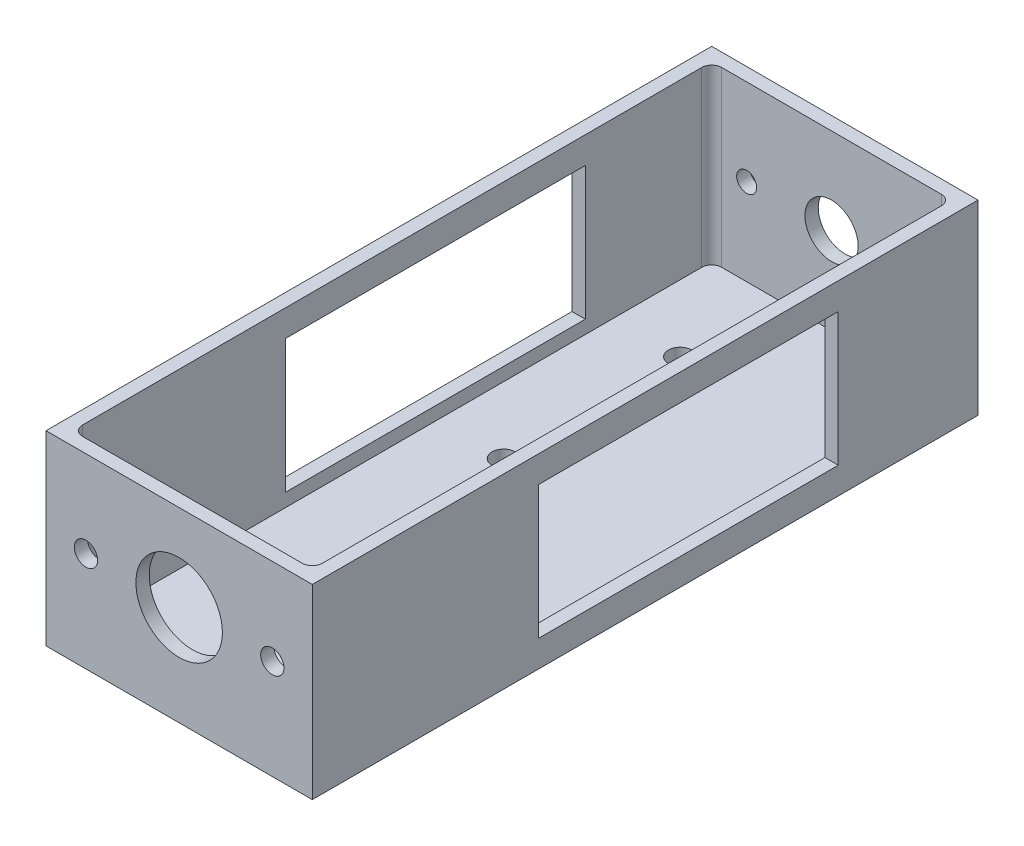
ISO-10303-21;
HEADER;
FILE_DESCRIPTION(('STEP AP214'),'2;1');
FILE_NAME('part.step','',(''),(''),'','','');
FILE_SCHEMA(('AUTOMOTIVE_DESIGN { 1 0 10303 214 1 1 1 1 }'));
ENDSEC;
DATA;
#1=APPLICATION_CONTEXT('core data for automotive mechanical design processes');
#2=APPLICATION_PROTOCOL_DEFINITION('international standard','automotive_design',2000,#1);
#3=PRODUCT_CONTEXT('',#1,'mechanical');
#4=PRODUCT('Part','Part','',(#3));
#5=PRODUCT_RELATED_PRODUCT_CATEGORY('part','',(#4));
#6=PRODUCT_DEFINITION_FORMATION('','',#4);
#7=PRODUCT_DEFINITION_CONTEXT('part definition',#1,'design');
#8=PRODUCT_DEFINITION('design','',#6,#7);
#9=PRODUCT_DEFINITION_SHAPE('','',#8);
#10=(LENGTH_UNIT() NAMED_UNIT(*) SI_UNIT(.MILLI.,.METRE.));
#11=(NAMED_UNIT(*) PLANE_ANGLE_UNIT() SI_UNIT($,.RADIAN.));
#12=(NAMED_UNIT(*) SI_UNIT($,.STERADIAN.) SOLID_ANGLE_UNIT());
#13=UNCERTAINTY_MEASURE_WITH_UNIT(LENGTH_MEASURE(1.E-05),#10,'distance_accuracy_value','');
#14=(GEOMETRIC_REPRESENTATION_CONTEXT(3) GLOBAL_UNCERTAINTY_ASSIGNED_CONTEXT((#13)) GLOBAL_UNIT_ASSIGNED_CONTEXT((#10,
#11,#12)) REPRESENTATION_CONTEXT('',''));
#15=CARTESIAN_POINT('',(0.,0.,0.));
#16=DIRECTION('',(0.,0.,1.));
#17=DIRECTION('',(1.,0.,0.));
#18=AXIS2_PLACEMENT_3D('',#15,#16,#17);
#19=CARTESIAN_POINT('',(-40.,28.,-200.));
#20=DIRECTION('',(0.,1.,0.));
#21=DIRECTION('',(0.,0.,1.));
#22=AXIS2_PLACEMENT_3D('',#19,#20,#21);
#23=PLANE('',#22);
#24=DIRECTION('',(-1.,0.,0.));
#25=VECTOR('',#24,1.);
#26=CARTESIAN_POINT('',(-40.,28.,0.));
#27=LINE('',#26,#25);
#28=CARTESIAN_POINT('',(40.,28.,0.));
#29=VERTEX_POINT('',#28);
#30=CARTESIAN_POINT('',(-40.,28.,0.));
#31=VERTEX_POINT('',#30);
#32=EDGE_CURVE('E344',#29,#31,#27,.T.);
#33=ORIENTED_EDGE('',*,*,#32,.F.);
#34=DIRECTION('',(0.,0.,1.));
#35=VECTOR('',#34,1.);
#36=CARTESIAN_POINT('',(40.,28.,-200.));
#37=LINE('',#36,#35);
#38=CARTESIAN_POINT('',(40.,28.,-200.));
#39=VERTEX_POINT('',#38);
#40=EDGE_CURVE('E341',#39,#29,#37,.T.);
#41=ORIENTED_EDGE('',*,*,#40,.F.);
#42=DIRECTION('',(-1.,0.,0.));
#43=VECTOR('',#42,1.);
#44=CARTESIAN_POINT('',(-40.,28.,-200.));
#45=LINE('',#44,#43);
#46=CARTESIAN_POINT('',(-40.,28.,-200.));
#47=VERTEX_POINT('',#46);
#48=EDGE_CURVE('E331',#39,#47,#45,.T.);
#49=ORIENTED_EDGE('',*,*,#48,.T.);
#50=DIRECTION('',(0.,0.,1.));
#51=VECTOR('',#50,1.);
#52=CARTESIAN_POINT('',(-40.,28.,-200.));
#53=LINE('',#52,#51);
#54=EDGE_CURVE('E357',#47,#31,#53,.T.);
#55=ORIENTED_EDGE('',*,*,#54,.T.);
#56=EDGE_LOOP('',(#33,#41,#49,#55));
#57=FACE_BOUND('',#56,.T.);
#58=DIRECTION('',(0.,0.,1.));
#59=VECTOR('',#58,1.);
#60=CARTESIAN_POINT('',(-36.,28.,0.));
#61=LINE('',#60,#59);
#62=CARTESIAN_POINT('',(-36.,28.,-193.));
#63=VERTEX_POINT('',#62);
#64=CARTESIAN_POINT('',(-36.,28.,-7.));
#65=VERTEX_POINT('',#64);
#66=EDGE_CURVE('E291',#63,#65,#61,.T.);
#67=ORIENTED_EDGE('',*,*,#66,.F.);
#68=CARTESIAN_POINT('',(-33.,28.,-193.));
#69=DIRECTION('',(0.,1.,0.));
#70=DIRECTION('',(0.,0.,1.));
#71=AXIS2_PLACEMENT_3D('',#68,#69,#70);
#72=CIRCLE('',#71,3.);
#73=CARTESIAN_POINT('',(-33.,28.,-196.));
#74=VERTEX_POINT('',#73);
#75=EDGE_CURVE('E288',#63,#74,#72,.F.);
#76=ORIENTED_EDGE('',*,*,#75,.T.);
#77=DIRECTION('',(-1.,0.,0.));
#78=VECTOR('',#77,1.);
#79=CARTESIAN_POINT('',(0.,28.,-196.));
#80=LINE('',#79,#78);
#81=CARTESIAN_POINT('',(33.,28.,-196.));
#82=VERTEX_POINT('',#81);
#83=EDGE_CURVE('E266',#82,#74,#80,.T.);
#84=ORIENTED_EDGE('',*,*,#83,.F.);
#85=CARTESIAN_POINT('',(33.,28.,-193.));
#86=DIRECTION('',(0.,1.,0.));
#87=DIRECTION('',(0.,0.,1.));
#88=AXIS2_PLACEMENT_3D('',#85,#86,#87);
#89=CIRCLE('',#88,3.00000000000001);
#90=CARTESIAN_POINT('',(36.,28.,-193.));
#91=VERTEX_POINT('',#90);
#92=EDGE_CURVE('E306',#91,#82,#89,.T.);
#93=ORIENTED_EDGE('',*,*,#92,.F.);
#94=DIRECTION('',(0.,0.,-1.));
#95=VECTOR('',#94,1.);
#96=CARTESIAN_POINT('',(36.,28.,0.));
#97=LINE('',#96,#95);
#98=CARTESIAN_POINT('',(36.,28.,-7.));
#99=VERTEX_POINT('',#98);
#100=EDGE_CURVE('E303',#99,#91,#97,.T.);
#101=ORIENTED_EDGE('',*,*,#100,.F.);
#102=CARTESIAN_POINT('',(33.,28.,-7.));
#103=DIRECTION('',(0.,1.,0.));
#104=DIRECTION('',(0.,0.,1.));
#105=AXIS2_PLACEMENT_3D('',#102,#103,#104);
#106=CIRCLE('',#105,3.);
#107=CARTESIAN_POINT('',(33.,28.,-4.));
#108=VERTEX_POINT('',#107);
#109=EDGE_CURVE('E300',#108,#99,#106,.T.);
#110=ORIENTED_EDGE('',*,*,#109,.F.);
#111=DIRECTION('',(1.,0.,0.));
#112=VECTOR('',#111,1.);
#113=CARTESIAN_POINT('',(0.,28.,-4.));
#114=LINE('',#113,#112);
#115=CARTESIAN_POINT('',(-33.,28.,-4.));
#116=VERTEX_POINT('',#115);
#117=EDGE_CURVE('E297',#116,#108,#114,.T.);
#118=ORIENTED_EDGE('',*,*,#117,.F.);
#119=CARTESIAN_POINT('',(-33.,28.,-7.));
#120=DIRECTION('',(0.,1.,0.));
#121=DIRECTION('',(0.,0.,1.));
#122=AXIS2_PLACEMENT_3D('',#119,#120,#121);
#123=CIRCLE('',#122,3.00000000000001);
#124=EDGE_CURVE('E294',#65,#116,#123,.T.);
#125=ORIENTED_EDGE('',*,*,#124,.F.);
#126=EDGE_LOOP('',(#67,#76,#84,#93,#101,#110,#118,#125));
#127=FACE_BOUND('',#126,.T.);
#128=ADVANCED_FACE('F34',(#57,#127),#23,.T.);
#129=CARTESIAN_POINT('',(40.,-28.,-200.));
#130=DIRECTION('',(1.,0.,0.));
#131=DIRECTION('',(0.,0.,-1.));
#132=AXIS2_PLACEMENT_3D('',#129,#130,#131);
#133=PLANE('',#132);
#134=DIRECTION('',(0.,1.,0.));
#135=VECTOR('',#134,1.);
#136=CARTESIAN_POINT('',(40.,-20.,-68.0147093473397));
#137=LINE('',#136,#135);
#138=CARTESIAN_POINT('',(40.,-20.,-68.0147093473397));
#139=VERTEX_POINT('',#138);
#140=CARTESIAN_POINT('',(40.,20.,-68.0147093473397));
#141=VERTEX_POINT('',#140);
#142=EDGE_CURVE('E178',#139,#141,#137,.T.);
#143=ORIENTED_EDGE('',*,*,#142,.T.);
#144=DIRECTION('',(0.,0.,-1.));
#145=VECTOR('',#144,1.);
#146=CARTESIAN_POINT('',(40.,20.,-158.01470934734));
#147=LINE('',#146,#145);
#148=CARTESIAN_POINT('',(40.,20.,-158.01470934734));
#149=VERTEX_POINT('',#148);
#150=EDGE_CURVE('E188',#141,#149,#147,.T.);
#151=ORIENTED_EDGE('',*,*,#150,.T.);
#152=DIRECTION('',(0.,-1.,0.));
#153=VECTOR('',#152,1.);
#154=CARTESIAN_POINT('',(40.,-20.,-158.01470934734));
#155=LINE('',#154,#153);
#156=CARTESIAN_POINT('',(40.,-20.,-158.01470934734));
#157=VERTEX_POINT('',#156);
#158=EDGE_CURVE('E49',#149,#157,#155,.T.);
#159=ORIENTED_EDGE('',*,*,#158,.T.);
#160=DIRECTION('',(0.,0.,1.));
#161=VECTOR('',#160,1.);
#162=CARTESIAN_POINT('',(40.,-20.,-158.01470934734));
#163=LINE('',#162,#161);
#164=EDGE_CURVE('E195',#157,#139,#163,.T.);
#165=ORIENTED_EDGE('',*,*,#164,.T.);
#166=EDGE_LOOP('',(#143,#151,#159,#165));
#167=FACE_BOUND('',#166,.T.);
#168=DIRECTION('',(0.,1.,0.));
#169=VECTOR('',#168,1.);
#170=CARTESIAN_POINT('',(40.,-28.,0.));
#171=LINE('',#170,#169);
#172=CARTESIAN_POINT('',(40.,-28.,0.));
#173=VERTEX_POINT('',#172);
#174=EDGE_CURVE('E313',#173,#29,#171,.T.);
#175=ORIENTED_EDGE('',*,*,#174,.F.);
#176=DIRECTION('',(0.,0.,1.));
#177=VECTOR('',#176,1.);
#178=CARTESIAN_POINT('',(40.,-28.,-200.));
#179=LINE('',#178,#177);
#180=CARTESIAN_POINT('',(40.,-28.,-200.));
#181=VERTEX_POINT('',#180);
#182=EDGE_CURVE('E352',#181,#173,#179,.T.);
#183=ORIENTED_EDGE('',*,*,#182,.F.);
#184=DIRECTION('',(0.,1.,0.));
#185=VECTOR('',#184,1.);
#186=CARTESIAN_POINT('',(40.,-28.,-200.));
#187=LINE('',#186,#185);
#188=EDGE_CURVE('E328',#181,#39,#187,.T.);
#189=ORIENTED_EDGE('',*,*,#188,.T.);
#190=ORIENTED_EDGE('',*,*,#40,.T.);
#191=EDGE_LOOP('',(#175,#183,#189,#190));
#192=FACE_BOUND('',#191,.T.);
#193=ADVANCED_FACE('F36',(#167,#192),#133,.T.);
#194=CARTESIAN_POINT('',(-40.,-28.,-200.));
#195=DIRECTION('',(0.,-1.,0.));
#196=DIRECTION('',(0.,0.,-1.));
#197=AXIS2_PLACEMENT_3D('',#194,#195,#196);
#198=PLANE('',#197);
#199=CARTESIAN_POINT('',(-16.,-28.,-113.500000000001));
#200=DIRECTION('',(0.,-1.,0.));
#201=DIRECTION('',(0.,0.,-1.));
#202=AXIS2_PLACEMENT_3D('',#199,#200,#201);
#203=CIRCLE('',#202,3.50000000000001);
#204=CARTESIAN_POINT('',(-16.,-28.,-117.000000000001));
#205=VERTEX_POINT('',#204);
#206=EDGE_CURVE('E230',#205,#205,#203,.T.);
#207=ORIENTED_EDGE('',*,*,#206,.F.);
#208=EDGE_LOOP('',(#207));
#209=FACE_BOUND('',#208,.T.);
#210=CARTESIAN_POINT('',(-16.,-28.,-166.5));
#211=DIRECTION('',(0.,-1.,0.));
#212=DIRECTION('',(0.,0.,-1.));
#213=AXIS2_PLACEMENT_3D('',#210,#211,#212);
#214=CIRCLE('',#213,3.50000000210109);
#215=CARTESIAN_POINT('',(-16.,-28.,-170.000000002101));
#216=VERTEX_POINT('',#215);
#217=EDGE_CURVE('E236',#216,#216,#214,.T.);
#218=ORIENTED_EDGE('',*,*,#217,.F.);
#219=EDGE_LOOP('',(#218));
#220=FACE_BOUND('',#219,.T.);
#221=DIRECTION('',(1.,0.,0.));
#222=VECTOR('',#221,1.);
#223=CARTESIAN_POINT('',(-40.,-28.,0.));
#224=LINE('',#223,#222);
#225=CARTESIAN_POINT('',(-40.,-28.,0.));
#226=VERTEX_POINT('',#225);
#227=EDGE_CURVE('E332',#226,#173,#224,.T.);
#228=ORIENTED_EDGE('',*,*,#227,.F.);
#229=DIRECTION('',(0.,0.,1.));
#230=VECTOR('',#229,1.);
#231=CARTESIAN_POINT('',(-40.,-28.,-200.));
#232=LINE('',#231,#230);
#233=CARTESIAN_POINT('',(-40.,-28.,-200.));
#234=VERTEX_POINT('',#233);
#235=EDGE_CURVE('E355',#234,#226,#232,.T.);
#236=ORIENTED_EDGE('',*,*,#235,.F.);
#237=DIRECTION('',(1.,0.,0.));
#238=VECTOR('',#237,1.);
#239=CARTESIAN_POINT('',(-40.,-28.,-200.));
#240=LINE('',#239,#238);
#241=EDGE_CURVE('E338',#234,#181,#240,.T.);
#242=ORIENTED_EDGE('',*,*,#241,.T.);
#243=ORIENTED_EDGE('',*,*,#182,.T.);
#244=EDGE_LOOP('',(#228,#236,#242,#243));
#245=FACE_BOUND('',#244,.T.);
#246=ADVANCED_FACE('F412',(#209,#220,#245),#198,.T.);
#247=CARTESIAN_POINT('',(-40.,-28.,-200.));
#248=DIRECTION('',(-1.,0.,0.));
#249=DIRECTION('',(0.,0.,1.));
#250=AXIS2_PLACEMENT_3D('',#247,#248,#249);
#251=PLANE('',#250);
#252=DIRECTION('',(0.,1.,0.));
#253=VECTOR('',#252,1.);
#254=CARTESIAN_POINT('',(-40.,-20.,-68.0147093473397));
#255=LINE('',#254,#253);
#256=CARTESIAN_POINT('',(-40.,-20.,-68.0147093473397));
#257=VERTEX_POINT('',#256);
#258=CARTESIAN_POINT('',(-40.,20.,-68.0147093473397));
#259=VERTEX_POINT('',#258);
#260=EDGE_CURVE('E57',#257,#259,#255,.T.);
#261=ORIENTED_EDGE('',*,*,#260,.F.);
#262=DIRECTION('',(0.,0.,1.));
#263=VECTOR('',#262,1.);
#264=CARTESIAN_POINT('',(-40.,-20.,-158.01470934734));
#265=LINE('',#264,#263);
#266=CARTESIAN_POINT('',(-40.,-20.,-158.01470934734));
#267=VERTEX_POINT('',#266);
#268=EDGE_CURVE('E196',#267,#257,#265,.T.);
#269=ORIENTED_EDGE('',*,*,#268,.F.);
#270=DIRECTION('',(0.,-1.,0.));
#271=VECTOR('',#270,1.);
#272=CARTESIAN_POINT('',(-40.,-20.,-158.01470934734));
#273=LINE('',#272,#271);
#274=CARTESIAN_POINT('',(-40.,20.,-158.01470934734));
#275=VERTEX_POINT('',#274);
#276=EDGE_CURVE('E199',#275,#267,#273,.T.);
#277=ORIENTED_EDGE('',*,*,#276,.F.);
#278=DIRECTION('',(0.,0.,-1.));
#279=VECTOR('',#278,1.);
#280=CARTESIAN_POINT('',(-40.,20.,-158.01470934734));
#281=LINE('',#280,#279);
#282=EDGE_CURVE('E205',#259,#275,#281,.T.);
#283=ORIENTED_EDGE('',*,*,#282,.F.);
#284=EDGE_LOOP('',(#261,#269,#277,#283));
#285=FACE_BOUND('',#284,.T.);
#286=DIRECTION('',(0.,-1.,0.));
#287=VECTOR('',#286,1.);
#288=CARTESIAN_POINT('',(-40.,-28.,0.));
#289=LINE('',#288,#287);
#290=EDGE_CURVE('E347',#31,#226,#289,.T.);
#291=ORIENTED_EDGE('',*,*,#290,.F.);
#292=ORIENTED_EDGE('',*,*,#54,.F.);
#293=DIRECTION('',(0.,-1.,0.));
#294=VECTOR('',#293,1.);
#295=CARTESIAN_POINT('',(-40.,-28.,-200.));
#296=LINE('',#295,#294);
#297=EDGE_CURVE('E335',#47,#234,#296,.T.);
#298=ORIENTED_EDGE('',*,*,#297,.T.);
#299=ORIENTED_EDGE('',*,*,#235,.T.);
#300=EDGE_LOOP('',(#291,#292,#298,#299));
#301=FACE_BOUND('',#300,.T.);
#302=ADVANCED_FACE('F391',(#285,#301),#251,.T.);
#303=CARTESIAN_POINT('',(0.,0.,-200.));
#304=DIRECTION('',(0.,0.,-1.));
#305=DIRECTION('',(-1.,0.,0.));
#306=AXIS2_PLACEMENT_3D('',#303,#304,#305);
#307=PLANE('',#306);
#308=CARTESIAN_POINT('',(25.5,2.,-200.));
#309=DIRECTION('',(0.,0.,-1.));
#310=DIRECTION('',(1.,0.,0.));
#311=AXIS2_PLACEMENT_3D('',#308,#309,#310);
#312=CIRCLE('',#311,3.);
#313=CARTESIAN_POINT('',(28.5,2.,-200.));
#314=VERTEX_POINT('',#313);
#315=EDGE_CURVE('E239',#314,#314,#312,.T.);
#316=ORIENTED_EDGE('',*,*,#315,.F.);
#317=EDGE_LOOP('',(#316));
#318=FACE_BOUND('',#317,.T.);
#319=CARTESIAN_POINT('',(-25.5,2.,-200.));
#320=DIRECTION('',(0.,0.,-1.));
#321=DIRECTION('',(-1.,0.,0.));
#322=AXIS2_PLACEMENT_3D('',#319,#320,#321);
#323=CIRCLE('',#322,3.);
#324=CARTESIAN_POINT('',(-28.5,2.,-200.));
#325=VERTEX_POINT('',#324);
#326=EDGE_CURVE('E243',#325,#325,#323,.T.);
#327=ORIENTED_EDGE('',*,*,#326,.F.);
#328=EDGE_LOOP('',(#327));
#329=FACE_BOUND('',#328,.T.);
#330=CARTESIAN_POINT('',(0.,2.,-200.));
#331=DIRECTION('',(0.,0.,-1.));
#332=DIRECTION('',(-1.,0.,0.));
#333=AXIS2_PLACEMENT_3D('',#330,#331,#332);
#334=CIRCLE('',#333,8.);
#335=CARTESIAN_POINT('',(-8.,2.,-200.));
#336=VERTEX_POINT('',#335);
#337=EDGE_CURVE('E247',#336,#336,#334,.T.);
#338=ORIENTED_EDGE('',*,*,#337,.F.);
#339=EDGE_LOOP('',(#338));
#340=FACE_BOUND('',#339,.T.);
#341=ORIENTED_EDGE('',*,*,#188,.F.);
#342=ORIENTED_EDGE('',*,*,#241,.F.);
#343=ORIENTED_EDGE('',*,*,#297,.F.);
#344=ORIENTED_EDGE('',*,*,#48,.F.);
#345=EDGE_LOOP('',(#341,#342,#343,#344));
#346=FACE_BOUND('',#345,.T.);
#347=ADVANCED_FACE('F418',(#318,#329,#340,#346),#307,.T.);
#348=CARTESIAN_POINT('',(0.,0.,0.));
#349=DIRECTION('',(0.,0.,-1.));
#350=DIRECTION('',(-1.,0.,0.));
#351=AXIS2_PLACEMENT_3D('',#348,#349,#350);
#352=PLANE('',#351);
#353=CARTESIAN_POINT('',(28.,2.00000000000001,0.));
#354=DIRECTION('',(0.,0.,1.));
#355=DIRECTION('',(1.,0.,0.));
#356=AXIS2_PLACEMENT_3D('',#353,#354,#355);
#357=CIRCLE('',#356,3.5);
#358=CARTESIAN_POINT('',(31.5,2.00000000000001,0.));
#359=VERTEX_POINT('',#358);
#360=EDGE_CURVE('E251',#359,#359,#357,.T.);
#361=ORIENTED_EDGE('',*,*,#360,.F.);
#362=EDGE_LOOP('',(#361));
#363=FACE_BOUND('',#362,.T.);
#364=CARTESIAN_POINT('',(0.,2.00000000000001,0.));
#365=DIRECTION('',(0.,0.,1.));
#366=DIRECTION('',(1.,0.,0.));
#367=AXIS2_PLACEMENT_3D('',#364,#365,#366);
#368=CIRCLE('',#367,13.);
#369=CARTESIAN_POINT('',(13.,2.00000000000001,0.));
#370=VERTEX_POINT('',#369);
#371=EDGE_CURVE('E255',#370,#370,#368,.T.);
#372=ORIENTED_EDGE('',*,*,#371,.F.);
#373=EDGE_LOOP('',(#372));
#374=FACE_BOUND('',#373,.T.);
#375=CARTESIAN_POINT('',(-28.,2.00000000000001,0.));
#376=DIRECTION('',(0.,0.,1.));
#377=DIRECTION('',(1.,0.,0.));
#378=AXIS2_PLACEMENT_3D('',#375,#376,#377);
#379=CIRCLE('',#378,3.50000000000001);
#380=CARTESIAN_POINT('',(-24.5,2.00000000000001,0.));
#381=VERTEX_POINT('',#380);
#382=EDGE_CURVE('E259',#381,#381,#379,.T.);
#383=ORIENTED_EDGE('',*,*,#382,.F.);
#384=EDGE_LOOP('',(#383));
#385=FACE_BOUND('',#384,.T.);
#386=ORIENTED_EDGE('',*,*,#174,.T.);
#387=ORIENTED_EDGE('',*,*,#32,.T.);
#388=ORIENTED_EDGE('',*,*,#290,.T.);
#389=ORIENTED_EDGE('',*,*,#227,.T.);
#390=EDGE_LOOP('',(#386,#387,#388,#389));
#391=FACE_BOUND('',#390,.T.);
#392=ADVANCED_FACE('F422',(#363,#374,#385,#391),#352,.F.);
#393=CARTESIAN_POINT('',(-33.,-24.,-193.));
#394=DIRECTION('',(0.,1.,0.));
#395=DIRECTION('',(0.,0.,1.));
#396=AXIS2_PLACEMENT_3D('',#393,#394,#395);
#397=CYLINDRICAL_SURFACE('',#396,3.);
#398=ORIENTED_EDGE('',*,*,#75,.F.);
#399=DIRECTION('',(0.,1.,0.));
#400=VECTOR('',#399,1.);
#401=CARTESIAN_POINT('',(-36.,-24.,-193.));
#402=LINE('',#401,#400);
#403=CARTESIAN_POINT('',(-36.,-24.,-193.));
#404=VERTEX_POINT('',#403);
#405=EDGE_CURVE('E287',#404,#63,#402,.T.);
#406=ORIENTED_EDGE('',*,*,#405,.F.);
#407=CARTESIAN_POINT('',(-33.,-24.,-193.));
#408=DIRECTION('',(0.,1.,0.));
#409=DIRECTION('',(0.,0.,1.));
#410=AXIS2_PLACEMENT_3D('',#407,#408,#409);
#411=CIRCLE('',#410,3.);
#412=CARTESIAN_POINT('',(-33.,-24.,-196.));
#413=VERTEX_POINT('',#412);
#414=EDGE_CURVE('E263',#404,#413,#411,.F.);
#415=ORIENTED_EDGE('',*,*,#414,.T.);
#416=DIRECTION('',(0.,1.,0.));
#417=VECTOR('',#416,1.);
#418=CARTESIAN_POINT('',(-33.,-24.,-196.));
#419=LINE('',#418,#417);
#420=EDGE_CURVE('E311',#413,#74,#419,.T.);
#421=ORIENTED_EDGE('',*,*,#420,.T.);
#422=EDGE_LOOP('',(#398,#406,#415,#421));
#423=FACE_BOUND('',#422,.T.);
#424=ADVANCED_FACE('F425',(#423),#397,.F.);
#425=CARTESIAN_POINT('',(0.,-24.,-196.));
#426=DIRECTION('',(0.,0.,-1.));
#427=DIRECTION('',(-1.,0.,0.));
#428=AXIS2_PLACEMENT_3D('',#425,#426,#427);
#429=PLANE('',#428);
#430=CARTESIAN_POINT('',(25.5,2.,-196.));
#431=DIRECTION('',(0.,0.,-1.));
#432=DIRECTION('',(-1.,0.,0.));
#433=AXIS2_PLACEMENT_3D('',#430,#431,#432);
#434=CIRCLE('',#433,3.);
#435=CARTESIAN_POINT('',(22.5,2.,-196.));
#436=VERTEX_POINT('',#435);
#437=EDGE_CURVE('E242',#436,#436,#434,.T.);
#438=ORIENTED_EDGE('',*,*,#437,.T.);
#439=EDGE_LOOP('',(#438));
#440=FACE_BOUND('',#439,.T.);
#441=CARTESIAN_POINT('',(-25.5,2.,-196.));
#442=DIRECTION('',(0.,0.,-1.));
#443=DIRECTION('',(-1.,0.,0.));
#444=AXIS2_PLACEMENT_3D('',#441,#442,#443);
#445=CIRCLE('',#444,3.);
#446=CARTESIAN_POINT('',(-28.5,2.,-196.));
#447=VERTEX_POINT('',#446);
#448=EDGE_CURVE('E246',#447,#447,#445,.T.);
#449=ORIENTED_EDGE('',*,*,#448,.T.);
#450=EDGE_LOOP('',(#449));
#451=FACE_BOUND('',#450,.T.);
#452=CARTESIAN_POINT('',(0.,2.,-196.));
#453=DIRECTION('',(0.,0.,-1.));
#454=DIRECTION('',(-1.,0.,0.));
#455=AXIS2_PLACEMENT_3D('',#452,#453,#454);
#456=CIRCLE('',#455,8.);
#457=CARTESIAN_POINT('',(-8.,2.,-196.));
#458=VERTEX_POINT('',#457);
#459=EDGE_CURVE('E250',#458,#458,#456,.T.);
#460=ORIENTED_EDGE('',*,*,#459,.T.);
#461=EDGE_LOOP('',(#460));
#462=FACE_BOUND('',#461,.T.);
#463=ORIENTED_EDGE('',*,*,#83,.T.);
#464=ORIENTED_EDGE('',*,*,#420,.F.);
#465=DIRECTION('',(-1.,0.,0.));
#466=VECTOR('',#465,1.);
#467=CARTESIAN_POINT('',(0.,-24.,-196.));
#468=LINE('',#467,#466);
#469=CARTESIAN_POINT('',(33.,-24.,-196.));
#470=VERTEX_POINT('',#469);
#471=EDGE_CURVE('E284',#470,#413,#468,.T.);
#472=ORIENTED_EDGE('',*,*,#471,.F.);
#473=DIRECTION('',(0.,1.,0.));
#474=VECTOR('',#473,1.);
#475=CARTESIAN_POINT('',(33.,-24.,-196.));
#476=LINE('',#475,#474);
#477=EDGE_CURVE('E314',#470,#82,#476,.T.);
#478=ORIENTED_EDGE('',*,*,#477,.T.);
#479=EDGE_LOOP('',(#463,#464,#472,#478));
#480=FACE_BOUND('',#479,.T.);
#481=ADVANCED_FACE('F432',(#440,#451,#462,#480),#429,.F.);
#482=CARTESIAN_POINT('',(33.,-24.,-193.));
#483=DIRECTION('',(0.,1.,0.));
#484=DIRECTION('',(0.,0.,1.));
#485=AXIS2_PLACEMENT_3D('',#482,#483,#484);
#486=CYLINDRICAL_SURFACE('',#485,3.00000000000001);
#487=ORIENTED_EDGE('',*,*,#92,.T.);
#488=ORIENTED_EDGE('',*,*,#477,.F.);
#489=CARTESIAN_POINT('',(33.,-24.,-193.));
#490=DIRECTION('',(0.,1.,0.));
#491=DIRECTION('',(0.,0.,1.));
#492=AXIS2_PLACEMENT_3D('',#489,#490,#491);
#493=CIRCLE('',#492,3.00000000000001);
#494=CARTESIAN_POINT('',(36.,-24.,-193.));
#495=VERTEX_POINT('',#494);
#496=EDGE_CURVE('E281',#495,#470,#493,.T.);
#497=ORIENTED_EDGE('',*,*,#496,.F.);
#498=DIRECTION('',(0.,1.,0.));
#499=VECTOR('',#498,1.);
#500=CARTESIAN_POINT('',(36.,-24.,-193.));
#501=LINE('',#500,#499);
#502=EDGE_CURVE('E316',#495,#91,#501,.T.);
#503=ORIENTED_EDGE('',*,*,#502,.T.);
#504=EDGE_LOOP('',(#487,#488,#497,#503));
#505=FACE_BOUND('',#504,.T.);
#506=ADVANCED_FACE('F452',(#505),#486,.F.);
#507=CARTESIAN_POINT('',(36.,-24.,0.));
#508=DIRECTION('',(1.,0.,0.));
#509=DIRECTION('',(0.,0.,-1.));
#510=AXIS2_PLACEMENT_3D('',#507,#508,#509);
#511=PLANE('',#510);
#512=DIRECTION('',(0.,0.,1.));
#513=VECTOR('',#512,1.);
#514=CARTESIAN_POINT('',(36.,20.,0.));
#515=LINE('',#514,#513);
#516=CARTESIAN_POINT('',(36.,20.,-158.01470934734));
#517=VERTEX_POINT('',#516);
#518=CARTESIAN_POINT('',(36.,20.,-68.0147093473397));
#519=VERTEX_POINT('',#518);
#520=EDGE_CURVE('E212',#517,#519,#515,.T.);
#521=ORIENTED_EDGE('',*,*,#520,.T.);
#522=DIRECTION('',(0.,-1.,0.));
#523=VECTOR('',#522,1.);
#524=CARTESIAN_POINT('',(36.,-24.,-68.0147093473397));
#525=LINE('',#524,#523);
#526=CARTESIAN_POINT('',(36.,-20.,-68.0147093473397));
#527=VERTEX_POINT('',#526);
#528=EDGE_CURVE('E181',#519,#527,#525,.T.);
#529=ORIENTED_EDGE('',*,*,#528,.T.);
#530=DIRECTION('',(0.,0.,-1.));
#531=VECTOR('',#530,1.);
#532=CARTESIAN_POINT('',(36.,-20.,0.));
#533=LINE('',#532,#531);
#534=CARTESIAN_POINT('',(36.,-20.,-158.01470934734));
#535=VERTEX_POINT('',#534);
#536=EDGE_CURVE('E223',#527,#535,#533,.T.);
#537=ORIENTED_EDGE('',*,*,#536,.T.);
#538=DIRECTION('',(0.,1.,0.));
#539=VECTOR('',#538,1.);
#540=CARTESIAN_POINT('',(36.,-24.,-158.01470934734));
#541=LINE('',#540,#539);
#542=EDGE_CURVE('E220',#535,#517,#541,.T.);
#543=ORIENTED_EDGE('',*,*,#542,.T.);
#544=EDGE_LOOP('',(#521,#529,#537,#543));
#545=FACE_BOUND('',#544,.T.);
#546=ORIENTED_EDGE('',*,*,#100,.T.);
#547=ORIENTED_EDGE('',*,*,#502,.F.);
#548=DIRECTION('',(0.,0.,-1.));
#549=VECTOR('',#548,1.);
#550=CARTESIAN_POINT('',(36.,-24.,0.));
#551=LINE('',#550,#549);
#552=CARTESIAN_POINT('',(36.,-24.,-7.));
#553=VERTEX_POINT('',#552);
#554=EDGE_CURVE('E278',#553,#495,#551,.T.);
#555=ORIENTED_EDGE('',*,*,#554,.F.);
#556=DIRECTION('',(0.,1.,0.));
#557=VECTOR('',#556,1.);
#558=CARTESIAN_POINT('',(36.,-24.,-7.));
#559=LINE('',#558,#557);
#560=EDGE_CURVE('E318',#553,#99,#559,.T.);
#561=ORIENTED_EDGE('',*,*,#560,.T.);
#562=EDGE_LOOP('',(#546,#547,#555,#561));
#563=FACE_BOUND('',#562,.T.);
#564=ADVANCED_FACE('F448',(#545,#563),#511,.F.);
#565=CARTESIAN_POINT('',(33.,-24.,-7.));
#566=DIRECTION('',(0.,1.,0.));
#567=DIRECTION('',(0.,0.,1.));
#568=AXIS2_PLACEMENT_3D('',#565,#566,#567);
#569=CYLINDRICAL_SURFACE('',#568,3.);
#570=ORIENTED_EDGE('',*,*,#109,.T.);
#571=ORIENTED_EDGE('',*,*,#560,.F.);
#572=CARTESIAN_POINT('',(33.,-24.,-7.));
#573=DIRECTION('',(0.,1.,0.));
#574=DIRECTION('',(0.,0.,1.));
#575=AXIS2_PLACEMENT_3D('',#572,#573,#574);
#576=CIRCLE('',#575,3.);
#577=CARTESIAN_POINT('',(33.,-24.,-4.));
#578=VERTEX_POINT('',#577);
#579=EDGE_CURVE('E275',#578,#553,#576,.T.);
#580=ORIENTED_EDGE('',*,*,#579,.F.);
#581=DIRECTION('',(0.,1.,0.));
#582=VECTOR('',#581,1.);
#583=CARTESIAN_POINT('',(33.,-24.,-4.));
#584=LINE('',#583,#582);
#585=EDGE_CURVE('E320',#578,#108,#584,.T.);
#586=ORIENTED_EDGE('',*,*,#585,.T.);
#587=EDGE_LOOP('',(#570,#571,#580,#586));
#588=FACE_BOUND('',#587,.T.);
#589=ADVANCED_FACE('F444',(#588),#569,.F.);
#590=CARTESIAN_POINT('',(0.,-24.,-4.));
#591=DIRECTION('',(0.,0.,1.));
#592=DIRECTION('',(1.,0.,0.));
#593=AXIS2_PLACEMENT_3D('',#590,#591,#592);
#594=PLANE('',#593);
#595=CARTESIAN_POINT('',(28.,2.00000000000001,-4.));
#596=DIRECTION('',(0.,0.,1.));
#597=DIRECTION('',(1.,0.,0.));
#598=AXIS2_PLACEMENT_3D('',#595,#596,#597);
#599=CIRCLE('',#598,3.5);
#600=CARTESIAN_POINT('',(31.5,2.00000000000001,-4.));
#601=VERTEX_POINT('',#600);
#602=EDGE_CURVE('E254',#601,#601,#599,.T.);
#603=ORIENTED_EDGE('',*,*,#602,.T.);
#604=EDGE_LOOP('',(#603));
#605=FACE_BOUND('',#604,.T.);
#606=CARTESIAN_POINT('',(0.,2.00000000000001,-4.));
#607=DIRECTION('',(0.,0.,1.));
#608=DIRECTION('',(1.,0.,0.));
#609=AXIS2_PLACEMENT_3D('',#606,#607,#608);
#610=CIRCLE('',#609,13.);
#611=CARTESIAN_POINT('',(13.,2.00000000000001,-4.));
#612=VERTEX_POINT('',#611);
#613=EDGE_CURVE('E258',#612,#612,#610,.T.);
#614=ORIENTED_EDGE('',*,*,#613,.T.);
#615=EDGE_LOOP('',(#614));
#616=FACE_BOUND('',#615,.T.);
#617=CARTESIAN_POINT('',(-28.,2.00000000000001,-4.));
#618=DIRECTION('',(0.,0.,1.));
#619=DIRECTION('',(1.,0.,0.));
#620=AXIS2_PLACEMENT_3D('',#617,#618,#619);
#621=CIRCLE('',#620,3.50000000000001);
#622=CARTESIAN_POINT('',(-24.5,2.00000000000001,-4.));
#623=VERTEX_POINT('',#622);
#624=EDGE_CURVE('E262',#623,#623,#621,.T.);
#625=ORIENTED_EDGE('',*,*,#624,.T.);
#626=EDGE_LOOP('',(#625));
#627=FACE_BOUND('',#626,.T.);
#628=ORIENTED_EDGE('',*,*,#117,.T.);
#629=ORIENTED_EDGE('',*,*,#585,.F.);
#630=DIRECTION('',(1.,0.,0.));
#631=VECTOR('',#630,1.);
#632=CARTESIAN_POINT('',(0.,-24.,-4.));
#633=LINE('',#632,#631);
#634=CARTESIAN_POINT('',(-33.,-24.,-4.));
#635=VERTEX_POINT('',#634);
#636=EDGE_CURVE('E272',#635,#578,#633,.T.);
#637=ORIENTED_EDGE('',*,*,#636,.F.);
#638=DIRECTION('',(0.,1.,0.));
#639=VECTOR('',#638,1.);
#640=CARTESIAN_POINT('',(-33.,-24.,-4.));
#641=LINE('',#640,#639);
#642=EDGE_CURVE('E322',#635,#116,#641,.T.);
#643=ORIENTED_EDGE('',*,*,#642,.T.);
#644=EDGE_LOOP('',(#628,#629,#637,#643));
#645=FACE_BOUND('',#644,.T.);
#646=ADVANCED_FACE('F440',(#605,#616,#627,#645),#594,.F.);
#647=CARTESIAN_POINT('',(-33.,-24.,-7.));
#648=DIRECTION('',(0.,1.,0.));
#649=DIRECTION('',(0.,0.,1.));
#650=AXIS2_PLACEMENT_3D('',#647,#648,#649);
#651=CYLINDRICAL_SURFACE('',#650,3.00000000000001);
#652=ORIENTED_EDGE('',*,*,#124,.T.);
#653=ORIENTED_EDGE('',*,*,#642,.F.);
#654=CARTESIAN_POINT('',(-33.,-24.,-7.));
#655=DIRECTION('',(0.,1.,0.));
#656=DIRECTION('',(0.,0.,1.));
#657=AXIS2_PLACEMENT_3D('',#654,#655,#656);
#658=CIRCLE('',#657,3.00000000000001);
#659=CARTESIAN_POINT('',(-36.,-24.,-7.));
#660=VERTEX_POINT('',#659);
#661=EDGE_CURVE('E269',#660,#635,#658,.T.);
#662=ORIENTED_EDGE('',*,*,#661,.F.);
#663=DIRECTION('',(0.,1.,0.));
#664=VECTOR('',#663,1.);
#665=CARTESIAN_POINT('',(-36.,-24.,-7.));
#666=LINE('',#665,#664);
#667=EDGE_CURVE('E324',#660,#65,#666,.T.);
#668=ORIENTED_EDGE('',*,*,#667,.T.);
#669=EDGE_LOOP('',(#652,#653,#662,#668));
#670=FACE_BOUND('',#669,.T.);
#671=ADVANCED_FACE('F437',(#670),#651,.F.);
#672=CARTESIAN_POINT('',(-36.,-24.,0.));
#673=DIRECTION('',(-1.,0.,0.));
#674=DIRECTION('',(0.,0.,1.));
#675=AXIS2_PLACEMENT_3D('',#672,#673,#674);
#676=PLANE('',#675);
#677=DIRECTION('',(0.,0.,1.));
#678=VECTOR('',#677,1.);
#679=CARTESIAN_POINT('',(-36.,-20.,0.));
#680=LINE('',#679,#678);
#681=CARTESIAN_POINT('',(-36.,-20.,-158.01470934734));
#682=VERTEX_POINT('',#681);
#683=CARTESIAN_POINT('',(-36.,-20.,-68.0147093473397));
#684=VERTEX_POINT('',#683);
#685=EDGE_CURVE('E42',#682,#684,#680,.T.);
#686=ORIENTED_EDGE('',*,*,#685,.T.);
#687=DIRECTION('',(0.,1.,0.));
#688=VECTOR('',#687,1.);
#689=CARTESIAN_POINT('',(-36.,-24.,-68.0147093473397));
#690=LINE('',#689,#688);
#691=CARTESIAN_POINT('',(-36.,20.,-68.0147093473397));
#692=VERTEX_POINT('',#691);
#693=EDGE_CURVE('E11',#684,#692,#690,.T.);
#694=ORIENTED_EDGE('',*,*,#693,.T.);
#695=DIRECTION('',(0.,0.,-1.));
#696=VECTOR('',#695,1.);
#697=CARTESIAN_POINT('',(-36.,20.,0.));
#698=LINE('',#697,#696);
#699=CARTESIAN_POINT('',(-36.,20.,-158.01470934734));
#700=VERTEX_POINT('',#699);
#701=EDGE_CURVE('E354',#692,#700,#698,.T.);
#702=ORIENTED_EDGE('',*,*,#701,.T.);
#703=DIRECTION('',(0.,-1.,0.));
#704=VECTOR('',#703,1.);
#705=CARTESIAN_POINT('',(-36.,-24.,-158.01470934734));
#706=LINE('',#705,#704);
#707=EDGE_CURVE('E374',#700,#682,#706,.T.);
#708=ORIENTED_EDGE('',*,*,#707,.T.);
#709=EDGE_LOOP('',(#686,#694,#702,#708));
#710=FACE_BOUND('',#709,.T.);
#711=ORIENTED_EDGE('',*,*,#66,.T.);
#712=ORIENTED_EDGE('',*,*,#667,.F.);
#713=DIRECTION('',(0.,0.,1.));
#714=VECTOR('',#713,1.);
#715=CARTESIAN_POINT('',(-36.,-24.,0.));
#716=LINE('',#715,#714);
#717=EDGE_CURVE('E265',#404,#660,#716,.T.);
#718=ORIENTED_EDGE('',*,*,#717,.F.);
#719=ORIENTED_EDGE('',*,*,#405,.T.);
#720=EDGE_LOOP('',(#711,#712,#718,#719));
#721=FACE_BOUND('',#720,.T.);
#722=ADVANCED_FACE('F378',(#710,#721),#676,.F.);
#723=CARTESIAN_POINT('',(0.,-24.,0.));
#724=DIRECTION('',(0.,1.,0.));
#725=DIRECTION('',(0.,0.,1.));
#726=AXIS2_PLACEMENT_3D('',#723,#724,#725);
#727=PLANE('',#726);
#728=CARTESIAN_POINT('',(-16.,-24.,-113.500000000001));
#729=DIRECTION('',(0.,1.,0.));
#730=DIRECTION('',(0.,0.,1.));
#731=AXIS2_PLACEMENT_3D('',#728,#729,#730);
#732=CIRCLE('',#731,3.50000000000001);
#733=CARTESIAN_POINT('',(-16.,-24.,-110.000000000001));
#734=VERTEX_POINT('',#733);
#735=EDGE_CURVE('E227',#734,#734,#732,.T.);
#736=ORIENTED_EDGE('',*,*,#735,.F.);
#737=EDGE_LOOP('',(#736));
#738=FACE_BOUND('',#737,.T.);
#739=CARTESIAN_POINT('',(-16.,-24.,-166.5));
#740=DIRECTION('',(0.,1.,0.));
#741=DIRECTION('',(0.,0.,1.));
#742=AXIS2_PLACEMENT_3D('',#739,#740,#741);
#743=CIRCLE('',#742,3.50000000210109);
#744=CARTESIAN_POINT('',(-16.,-24.,-162.999999997898));
#745=VERTEX_POINT('',#744);
#746=EDGE_CURVE('E233',#745,#745,#743,.T.);
#747=ORIENTED_EDGE('',*,*,#746,.F.);
#748=EDGE_LOOP('',(#747));
#749=FACE_BOUND('',#748,.T.);
#750=ORIENTED_EDGE('',*,*,#414,.F.);
#751=ORIENTED_EDGE('',*,*,#717,.T.);
#752=ORIENTED_EDGE('',*,*,#661,.T.);
#753=ORIENTED_EDGE('',*,*,#636,.T.);
#754=ORIENTED_EDGE('',*,*,#579,.T.);
#755=ORIENTED_EDGE('',*,*,#554,.T.);
#756=ORIENTED_EDGE('',*,*,#496,.T.);
#757=ORIENTED_EDGE('',*,*,#471,.T.);
#758=EDGE_LOOP('',(#750,#751,#752,#753,#754,#755,#756,#757));
#759=FACE_BOUND('',#758,.T.);
#760=ADVANCED_FACE('F436',(#738,#749,#759),#727,.T.);
#761=CARTESIAN_POINT('',(-28.,2.00000000000001,-10.));
#762=DIRECTION('',(0.,0.,1.));
#763=DIRECTION('',(1.,0.,0.));
#764=AXIS2_PLACEMENT_3D('',#761,#762,#763);
#765=CYLINDRICAL_SURFACE('',#764,3.50000000000001);
#766=ORIENTED_EDGE('',*,*,#382,.T.);
#767=EDGE_LOOP('',(#766));
#768=FACE_BOUND('',#767,.T.);
#769=ORIENTED_EDGE('',*,*,#624,.F.);
#770=EDGE_LOOP('',(#769));
#771=FACE_BOUND('',#770,.T.);
#772=ADVANCED_FACE('F462',(#768,#771),#765,.F.);
#773=CARTESIAN_POINT('',(0.,2.00000000000001,-10.));
#774=DIRECTION('',(0.,0.,1.));
#775=DIRECTION('',(1.,0.,0.));
#776=AXIS2_PLACEMENT_3D('',#773,#774,#775);
#777=CYLINDRICAL_SURFACE('',#776,13.);
#778=ORIENTED_EDGE('',*,*,#371,.T.);
#779=EDGE_LOOP('',(#778));
#780=FACE_BOUND('',#779,.T.);
#781=ORIENTED_EDGE('',*,*,#613,.F.);
#782=EDGE_LOOP('',(#781));
#783=FACE_BOUND('',#782,.T.);
#784=ADVANCED_FACE('F466',(#780,#783),#777,.F.);
#785=CARTESIAN_POINT('',(28.,2.00000000000001,-10.));
#786=DIRECTION('',(0.,0.,1.));
#787=DIRECTION('',(1.,0.,0.));
#788=AXIS2_PLACEMENT_3D('',#785,#786,#787);
#789=CYLINDRICAL_SURFACE('',#788,3.5);
#790=ORIENTED_EDGE('',*,*,#360,.T.);
#791=EDGE_LOOP('',(#790));
#792=FACE_BOUND('',#791,.T.);
#793=ORIENTED_EDGE('',*,*,#602,.F.);
#794=EDGE_LOOP('',(#793));
#795=FACE_BOUND('',#794,.T.);
#796=ADVANCED_FACE('F470',(#792,#795),#789,.F.);
#797=CARTESIAN_POINT('',(0.,2.,-190.));
#798=DIRECTION('',(0.,0.,-1.));
#799=DIRECTION('',(-1.,0.,0.));
#800=AXIS2_PLACEMENT_3D('',#797,#798,#799);
#801=CYLINDRICAL_SURFACE('',#800,8.);
#802=ORIENTED_EDGE('',*,*,#337,.T.);
#803=EDGE_LOOP('',(#802));
#804=FACE_BOUND('',#803,.T.);
#805=ORIENTED_EDGE('',*,*,#459,.F.);
#806=EDGE_LOOP('',(#805));
#807=FACE_BOUND('',#806,.T.);
#808=ADVANCED_FACE('F474',(#804,#807),#801,.F.);
#809=CARTESIAN_POINT('',(-25.5,2.,-190.));
#810=DIRECTION('',(0.,0.,-1.));
#811=DIRECTION('',(-1.,0.,0.));
#812=AXIS2_PLACEMENT_3D('',#809,#810,#811);
#813=CYLINDRICAL_SURFACE('',#812,3.);
#814=ORIENTED_EDGE('',*,*,#326,.T.);
#815=EDGE_LOOP('',(#814));
#816=FACE_BOUND('',#815,.T.);
#817=ORIENTED_EDGE('',*,*,#448,.F.);
#818=EDGE_LOOP('',(#817));
#819=FACE_BOUND('',#818,.T.);
#820=ADVANCED_FACE('F478',(#816,#819),#813,.F.);
#821=CARTESIAN_POINT('',(25.5,2.,-190.));
#822=DIRECTION('',(0.,0.,-1.));
#823=DIRECTION('',(-1.,0.,0.));
#824=AXIS2_PLACEMENT_3D('',#821,#822,#823);
#825=CYLINDRICAL_SURFACE('',#824,3.);
#826=ORIENTED_EDGE('',*,*,#315,.T.);
#827=EDGE_LOOP('',(#826));
#828=FACE_BOUND('',#827,.T.);
#829=ORIENTED_EDGE('',*,*,#437,.F.);
#830=EDGE_LOOP('',(#829));
#831=FACE_BOUND('',#830,.T.);
#832=ADVANCED_FACE('F482',(#828,#831),#825,.F.);
#833=CARTESIAN_POINT('',(-16.,-34.,-166.5));
#834=DIRECTION('',(0.,1.,0.));
#835=DIRECTION('',(0.,0.,1.));
#836=AXIS2_PLACEMENT_3D('',#833,#834,#835);
#837=CYLINDRICAL_SURFACE('',#836,3.50000000210109);
#838=ORIENTED_EDGE('',*,*,#217,.T.);
#839=EDGE_LOOP('',(#838));
#840=FACE_BOUND('',#839,.T.);
#841=ORIENTED_EDGE('',*,*,#746,.T.);
#842=EDGE_LOOP('',(#841));
#843=FACE_BOUND('',#842,.T.);
#844=ADVANCED_FACE('F486',(#840,#843),#837,.F.);
#845=CARTESIAN_POINT('',(-16.,-34.,-113.500000000001));
#846=DIRECTION('',(0.,1.,0.));
#847=DIRECTION('',(0.,0.,1.));
#848=AXIS2_PLACEMENT_3D('',#845,#846,#847);
#849=CYLINDRICAL_SURFACE('',#848,3.50000000000001);
#850=ORIENTED_EDGE('',*,*,#206,.T.);
#851=EDGE_LOOP('',(#850));
#852=FACE_BOUND('',#851,.T.);
#853=ORIENTED_EDGE('',*,*,#735,.T.);
#854=EDGE_LOOP('',(#853));
#855=FACE_BOUND('',#854,.T.);
#856=ADVANCED_FACE('F489',(#852,#855),#849,.F.);
#857=CARTESIAN_POINT('',(40.,20.,-158.01470934734));
#858=DIRECTION('',(0.,1.,0.));
#859=DIRECTION('',(0.,0.,1.));
#860=AXIS2_PLACEMENT_3D('',#857,#858,#859);
#861=PLANE('',#860);
#862=DIRECTION('',(-1.,0.,0.));
#863=VECTOR('',#862,1.);
#864=CARTESIAN_POINT('',(40.,20.,-68.0147093473397));
#865=LINE('',#864,#863);
#866=EDGE_CURVE('E185',#692,#259,#865,.T.);
#867=ORIENTED_EDGE('',*,*,#866,.T.);
#868=ORIENTED_EDGE('',*,*,#282,.T.);
#869=DIRECTION('',(-1.,0.,0.));
#870=VECTOR('',#869,1.);
#871=CARTESIAN_POINT('',(40.,20.,-158.01470934734));
#872=LINE('',#871,#870);
#873=EDGE_CURVE('E184',#700,#275,#872,.T.);
#874=ORIENTED_EDGE('',*,*,#873,.F.);
#875=ORIENTED_EDGE('',*,*,#701,.F.);
#876=EDGE_LOOP('',(#867,#868,#874,#875));
#877=FACE_BOUND('',#876,.T.);
#878=ADVANCED_FACE('F394',(#877),#861,.F.);
#879=CARTESIAN_POINT('',(40.,-20.,-158.01470934734));
#880=DIRECTION('',(0.,0.,-1.));
#881=DIRECTION('',(-1.,0.,0.));
#882=AXIS2_PLACEMENT_3D('',#879,#880,#881);
#883=PLANE('',#882);
#884=ORIENTED_EDGE('',*,*,#873,.T.);
#885=ORIENTED_EDGE('',*,*,#276,.T.);
#886=DIRECTION('',(-1.,0.,0.));
#887=VECTOR('',#886,1.);
#888=CARTESIAN_POINT('',(40.,-20.,-158.01470934734));
#889=LINE('',#888,#887);
#890=EDGE_CURVE('E217',#682,#267,#889,.T.);
#891=ORIENTED_EDGE('',*,*,#890,.F.);
#892=ORIENTED_EDGE('',*,*,#707,.F.);
#893=EDGE_LOOP('',(#884,#885,#891,#892));
#894=FACE_BOUND('',#893,.T.);
#895=ADVANCED_FACE('F386',(#894),#883,.F.);
#896=CARTESIAN_POINT('',(40.,-20.,-158.01470934734));
#897=DIRECTION('',(0.,-1.,0.));
#898=DIRECTION('',(0.,0.,-1.));
#899=AXIS2_PLACEMENT_3D('',#896,#897,#898);
#900=PLANE('',#899);
#901=ORIENTED_EDGE('',*,*,#890,.T.);
#902=ORIENTED_EDGE('',*,*,#268,.T.);
#903=DIRECTION('',(-1.,0.,0.));
#904=VECTOR('',#903,1.);
#905=CARTESIAN_POINT('',(40.,-20.,-68.0147093473397));
#906=LINE('',#905,#904);
#907=EDGE_CURVE('E213',#684,#257,#906,.T.);
#908=ORIENTED_EDGE('',*,*,#907,.F.);
#909=ORIENTED_EDGE('',*,*,#685,.F.);
#910=EDGE_LOOP('',(#901,#902,#908,#909));
#911=FACE_BOUND('',#910,.T.);
#912=ADVANCED_FACE('F384',(#911),#900,.F.);
#913=CARTESIAN_POINT('',(40.,-20.,-68.0147093473397));
#914=DIRECTION('',(0.,0.,1.));
#915=DIRECTION('',(1.,0.,0.));
#916=AXIS2_PLACEMENT_3D('',#913,#914,#915);
#917=PLANE('',#916);
#918=ORIENTED_EDGE('',*,*,#907,.T.);
#919=ORIENTED_EDGE('',*,*,#260,.T.);
#920=ORIENTED_EDGE('',*,*,#866,.F.);
#921=ORIENTED_EDGE('',*,*,#693,.F.);
#922=EDGE_LOOP('',(#918,#919,#920,#921));
#923=FACE_BOUND('',#922,.T.);
#924=ADVANCED_FACE('F395',(#923),#917,.F.);
#925=EDGE_CURVE('E173',#141,#519,#865,.T.);
#926=ORIENTED_EDGE('',*,*,#925,.F.);
#927=ORIENTED_EDGE('',*,*,#142,.F.);
#928=EDGE_CURVE('E210',#139,#527,#906,.T.);
#929=ORIENTED_EDGE('',*,*,#928,.T.);
#930=ORIENTED_EDGE('',*,*,#528,.F.);
#931=EDGE_LOOP('',(#926,#927,#929,#930));
#932=FACE_BOUND('',#931,.T.);
#933=ADVANCED_FACE('F175',(#932),#917,.F.);
#934=ORIENTED_EDGE('',*,*,#928,.F.);
#935=ORIENTED_EDGE('',*,*,#164,.F.);
#936=EDGE_CURVE('E214',#157,#535,#889,.T.);
#937=ORIENTED_EDGE('',*,*,#936,.T.);
#938=ORIENTED_EDGE('',*,*,#536,.F.);
#939=EDGE_LOOP('',(#934,#935,#937,#938));
#940=FACE_BOUND('',#939,.T.);
#941=ADVANCED_FACE('F402',(#940),#900,.F.);
#942=ORIENTED_EDGE('',*,*,#936,.F.);
#943=ORIENTED_EDGE('',*,*,#158,.F.);
#944=EDGE_CURVE('E190',#149,#517,#872,.T.);
#945=ORIENTED_EDGE('',*,*,#944,.T.);
#946=ORIENTED_EDGE('',*,*,#542,.F.);
#947=EDGE_LOOP('',(#942,#943,#945,#946));
#948=FACE_BOUND('',#947,.T.);
#949=ADVANCED_FACE('F538',(#948),#883,.F.);
#950=ORIENTED_EDGE('',*,*,#944,.F.);
#951=ORIENTED_EDGE('',*,*,#150,.F.);
#952=ORIENTED_EDGE('',*,*,#925,.T.);
#953=ORIENTED_EDGE('',*,*,#520,.F.);
#954=EDGE_LOOP('',(#950,#951,#952,#953));
#955=FACE_BOUND('',#954,.T.);
#956=ADVANCED_FACE('F189',(#955),#861,.F.);
#957=CLOSED_SHELL('',(#128,#193,#246,#302,#347,#392,#424,#481,#506,#564,#589,#646,#671,#722,
#760,#772,#784,#796,#808,#820,#832,#844,#856,#878,#895,#912,#924,#933,#941,#949,#956));
#958=MANIFOLD_SOLID_BREP('B2',#957);
#959=ADVANCED_BREP_SHAPE_REPRESENTATION('',(#18,#958),#14);
#960=SHAPE_DEFINITION_REPRESENTATION(#9,#959);
ENDSEC;
END-ISO-10303-21;
